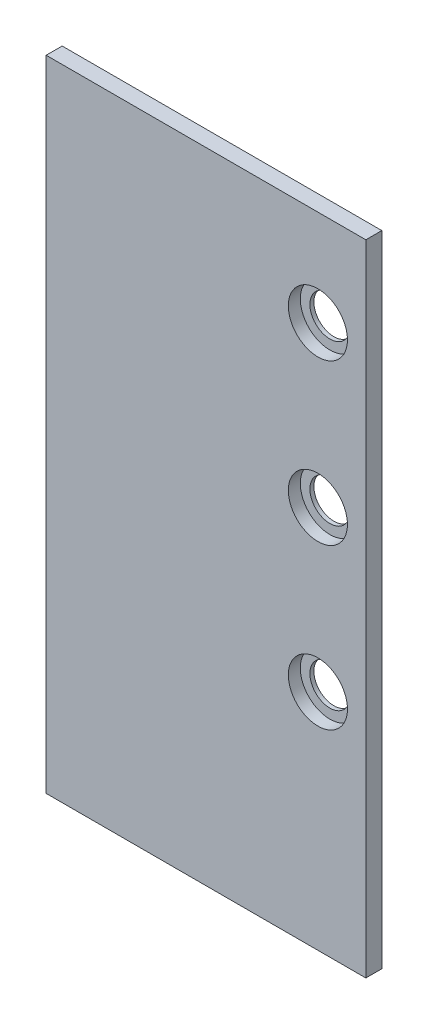
ISO-10303-21;
HEADER;
FILE_DESCRIPTION(('STEP AP214'),'2;1');
FILE_NAME('part.step','',(''),(''),'','','');
FILE_SCHEMA(('AUTOMOTIVE_DESIGN { 1 0 10303 214 1 1 1 1 }'));
ENDSEC;
DATA;
#1=APPLICATION_CONTEXT('core data for automotive mechanical design processes');
#2=APPLICATION_PROTOCOL_DEFINITION('international standard','automotive_design',2000,#1);
#3=PRODUCT_CONTEXT('',#1,'mechanical');
#4=PRODUCT('Part','Part','',(#3));
#5=PRODUCT_RELATED_PRODUCT_CATEGORY('part','',(#4));
#6=PRODUCT_DEFINITION_FORMATION('','',#4);
#7=PRODUCT_DEFINITION_CONTEXT('part definition',#1,'design');
#8=PRODUCT_DEFINITION('design','',#6,#7);
#9=PRODUCT_DEFINITION_SHAPE('','',#8);
#10=(LENGTH_UNIT() NAMED_UNIT(*) SI_UNIT(.MILLI.,.METRE.));
#11=(NAMED_UNIT(*) PLANE_ANGLE_UNIT() SI_UNIT($,.RADIAN.));
#12=(NAMED_UNIT(*) SI_UNIT($,.STERADIAN.) SOLID_ANGLE_UNIT());
#13=UNCERTAINTY_MEASURE_WITH_UNIT(LENGTH_MEASURE(1.E-05),#10,'distance_accuracy_value','');
#14=(GEOMETRIC_REPRESENTATION_CONTEXT(3) GLOBAL_UNCERTAINTY_ASSIGNED_CONTEXT((#13)) GLOBAL_UNIT_ASSIGNED_CONTEXT((#10,
#11,#12)) REPRESENTATION_CONTEXT('',''));
#15=CARTESIAN_POINT('',(0.,0.,0.));
#16=DIRECTION('',(0.,0.,1.));
#17=DIRECTION('',(1.,0.,0.));
#18=AXIS2_PLACEMENT_3D('',#15,#16,#17);
#19=CARTESIAN_POINT('',(65.5497332654698,303.566449619798,-3.175));
#20=DIRECTION('',(0.,0.,1.));
#21=DIRECTION('',(1.,0.,0.));
#22=AXIS2_PLACEMENT_3D('',#19,#20,#21);
#23=CYLINDRICAL_SURFACE('',#22,7.93749999999998);
#24=CARTESIAN_POINT('',(65.5497332654698,303.566449619798,-3.175));
#25=DIRECTION('',(0.,0.,1.));
#26=DIRECTION('',(1.,0.,0.));
#27=AXIS2_PLACEMENT_3D('',#24,#25,#26);
#28=CIRCLE('',#27,7.93749999999998);
#29=CARTESIAN_POINT('',(73.4872332654698,303.566449619798,-3.175));
#30=VERTEX_POINT('',#29);
#31=EDGE_CURVE('E113',#30,#30,#28,.T.);
#32=ORIENTED_EDGE('',*,*,#31,.F.);
#33=EDGE_LOOP('',(#32));
#34=FACE_BOUND('',#33,.T.);
#35=CARTESIAN_POINT('',(65.5497332654698,303.566449619798,-1.5875));
#36=DIRECTION('',(0.,0.,1.));
#37=DIRECTION('',(1.,0.,0.));
#38=AXIS2_PLACEMENT_3D('',#35,#36,#37);
#39=CIRCLE('',#38,7.93749999999998);
#40=CARTESIAN_POINT('',(73.4872332654698,303.566449619798,-1.5875));
#41=VERTEX_POINT('',#40);
#42=EDGE_CURVE('E11',#41,#41,#39,.T.);
#43=ORIENTED_EDGE('',*,*,#42,.T.);
#44=EDGE_LOOP('',(#43));
#45=FACE_BOUND('',#44,.T.);
#46=ADVANCED_FACE('F33',(#34,#45),#23,.F.);
#47=CARTESIAN_POINT('',(65.5497332654698,303.566449619798,-1.5875));
#48=DIRECTION('',(0.,0.,1.));
#49=DIRECTION('',(1.,0.,0.));
#50=AXIS2_PLACEMENT_3D('',#47,#48,#49);
#51=PLANE('',#50);
#52=ORIENTED_EDGE('',*,*,#42,.F.);
#53=EDGE_LOOP('',(#52));
#54=FACE_BOUND('',#53,.T.);
#55=CARTESIAN_POINT('',(65.5497332654698,303.566449619798,-1.5875));
#56=DIRECTION('',(0.,0.,1.));
#57=DIRECTION('',(1.,0.,0.));
#58=AXIS2_PLACEMENT_3D('',#55,#56,#57);
#59=CIRCLE('',#58,11.7475);
#60=CARTESIAN_POINT('',(77.2972332654698,303.566449619798,-1.5875));
#61=VERTEX_POINT('',#60);
#62=EDGE_CURVE('E41',#61,#61,#59,.T.);
#63=ORIENTED_EDGE('',*,*,#62,.T.);
#64=EDGE_LOOP('',(#63));
#65=FACE_BOUND('',#64,.T.);
#66=ADVANCED_FACE('F121',(#54,#65),#51,.T.);
#67=CARTESIAN_POINT('',(65.5497332654698,303.566449619798,-1.5875));
#68=DIRECTION('',(0.,0.,1.));
#69=DIRECTION('',(1.,0.,0.));
#70=AXIS2_PLACEMENT_3D('',#67,#68,#69);
#71=CYLINDRICAL_SURFACE('',#70,11.7475);
#72=ORIENTED_EDGE('',*,*,#62,.F.);
#73=EDGE_LOOP('',(#72));
#74=FACE_BOUND('',#73,.T.);
#75=CARTESIAN_POINT('',(65.5497332654698,303.566449619798,3.175));
#76=DIRECTION('',(0.,0.,1.));
#77=DIRECTION('',(1.,0.,0.));
#78=AXIS2_PLACEMENT_3D('',#75,#76,#77);
#79=CIRCLE('',#78,11.7475);
#80=CARTESIAN_POINT('',(77.2972332654698,303.566449619798,3.175));
#81=VERTEX_POINT('',#80);
#82=EDGE_CURVE('E116',#81,#81,#79,.T.);
#83=ORIENTED_EDGE('',*,*,#82,.T.);
#84=EDGE_LOOP('',(#83));
#85=FACE_BOUND('',#84,.T.);
#86=ADVANCED_FACE('F123',(#74,#85),#71,.F.);
#87=CARTESIAN_POINT('',(84.5997332654698,341.666449619798,3.175));
#88=DIRECTION('',(-1.,0.,0.));
#89=DIRECTION('',(0.,-1.,0.));
#90=AXIS2_PLACEMENT_3D('',#87,#88,#89);
#91=PLANE('',#90);
#92=DIRECTION('',(0.,1.,0.));
#93=VECTOR('',#92,1.);
#94=CARTESIAN_POINT('',(84.5997332654698,341.666449619798,-3.175));
#95=LINE('',#94,#93);
#96=CARTESIAN_POINT('',(84.5997332654698,87.6664496197977,-3.175));
#97=VERTEX_POINT('',#96);
#98=CARTESIAN_POINT('',(84.5997332654698,341.666449619798,-3.175));
#99=VERTEX_POINT('',#98);
#100=EDGE_CURVE('E102',#97,#99,#95,.T.);
#101=ORIENTED_EDGE('',*,*,#100,.T.);
#102=DIRECTION('',(0.,0.,-1.));
#103=VECTOR('',#102,1.);
#104=CARTESIAN_POINT('',(84.5997332654698,341.666449619798,3.175));
#105=LINE('',#104,#103);
#106=CARTESIAN_POINT('',(84.5997332654698,341.666449619798,3.175));
#107=VERTEX_POINT('',#106);
#108=EDGE_CURVE('E93',#107,#99,#105,.T.);
#109=ORIENTED_EDGE('',*,*,#108,.F.);
#110=DIRECTION('',(0.,1.,0.));
#111=VECTOR('',#110,1.);
#112=CARTESIAN_POINT('',(84.5997332654698,341.666449619798,3.175));
#113=LINE('',#112,#111);
#114=CARTESIAN_POINT('',(84.5997332654698,87.6664496197977,3.175));
#115=VERTEX_POINT('',#114);
#116=EDGE_CURVE('E85',#115,#107,#113,.T.);
#117=ORIENTED_EDGE('',*,*,#116,.F.);
#118=DIRECTION('',(0.,0.,-1.));
#119=VECTOR('',#118,1.);
#120=CARTESIAN_POINT('',(84.5997332654698,87.6664496197977,3.175));
#121=LINE('',#120,#119);
#122=EDGE_CURVE('E98',#115,#97,#121,.T.);
#123=ORIENTED_EDGE('',*,*,#122,.T.);
#124=EDGE_LOOP('',(#101,#109,#117,#123));
#125=FACE_BOUND('',#124,.T.);
#126=ADVANCED_FACE('F126',(#125),#91,.F.);
#127=CARTESIAN_POINT('',(84.5997332654698,341.666449619798,3.175));
#128=DIRECTION('',(0.,-1.,0.));
#129=DIRECTION('',(0.,0.,-1.));
#130=AXIS2_PLACEMENT_3D('',#127,#128,#129);
#131=PLANE('',#130);
#132=DIRECTION('',(-1.,0.,0.));
#133=VECTOR('',#132,1.);
#134=CARTESIAN_POINT('',(84.5997332654698,341.666449619798,-3.175));
#135=LINE('',#134,#133);
#136=CARTESIAN_POINT('',(-42.4002667345302,341.666449619798,-3.175));
#137=VERTEX_POINT('',#136);
#138=EDGE_CURVE('E91',#99,#137,#135,.T.);
#139=ORIENTED_EDGE('',*,*,#138,.T.);
#140=DIRECTION('',(0.,0.,-1.));
#141=VECTOR('',#140,1.);
#142=CARTESIAN_POINT('',(-42.4002667345302,341.666449619798,3.175));
#143=LINE('',#142,#141);
#144=CARTESIAN_POINT('',(-42.4002667345302,341.666449619798,3.175));
#145=VERTEX_POINT('',#144);
#146=EDGE_CURVE('E89',#145,#137,#143,.T.);
#147=ORIENTED_EDGE('',*,*,#146,.F.);
#148=DIRECTION('',(-1.,0.,0.));
#149=VECTOR('',#148,1.);
#150=CARTESIAN_POINT('',(84.5997332654698,341.666449619798,3.175));
#151=LINE('',#150,#149);
#152=EDGE_CURVE('E78',#107,#145,#151,.T.);
#153=ORIENTED_EDGE('',*,*,#152,.F.);
#154=ORIENTED_EDGE('',*,*,#108,.T.);
#155=EDGE_LOOP('',(#139,#147,#153,#154));
#156=FACE_BOUND('',#155,.T.);
#157=ADVANCED_FACE('F90',(#156),#131,.F.);
#158=CARTESIAN_POINT('',(-42.4002667345302,341.666449619798,3.175));
#159=DIRECTION('',(1.,0.,0.));
#160=DIRECTION('',(0.,1.,0.));
#161=AXIS2_PLACEMENT_3D('',#158,#159,#160);
#162=PLANE('',#161);
#163=DIRECTION('',(0.,-1.,0.));
#164=VECTOR('',#163,1.);
#165=CARTESIAN_POINT('',(-42.4002667345302,341.666449619798,-3.175));
#166=LINE('',#165,#164);
#167=CARTESIAN_POINT('',(-42.4002667345302,87.6664496197977,-3.175));
#168=VERTEX_POINT('',#167);
#169=EDGE_CURVE('E107',#137,#168,#166,.T.);
#170=ORIENTED_EDGE('',*,*,#169,.T.);
#171=DIRECTION('',(0.,0.,-1.));
#172=VECTOR('',#171,1.);
#173=CARTESIAN_POINT('',(-42.4002667345302,87.6664496197977,3.175));
#174=LINE('',#173,#172);
#175=CARTESIAN_POINT('',(-42.4002667345302,87.6664496197977,3.175));
#176=VERTEX_POINT('',#175);
#177=EDGE_CURVE('E94',#176,#168,#174,.T.);
#178=ORIENTED_EDGE('',*,*,#177,.F.);
#179=DIRECTION('',(0.,-1.,0.));
#180=VECTOR('',#179,1.);
#181=CARTESIAN_POINT('',(-42.4002667345302,341.666449619798,3.175));
#182=LINE('',#181,#180);
#183=EDGE_CURVE('E82',#145,#176,#182,.T.);
#184=ORIENTED_EDGE('',*,*,#183,.F.);
#185=ORIENTED_EDGE('',*,*,#146,.T.);
#186=EDGE_LOOP('',(#170,#178,#184,#185));
#187=FACE_BOUND('',#186,.T.);
#188=ADVANCED_FACE('F96',(#187),#162,.F.);
#189=CARTESIAN_POINT('',(84.5997332654698,87.6664496197977,3.175));
#190=DIRECTION('',(0.,1.,0.));
#191=DIRECTION('',(0.,0.,1.));
#192=AXIS2_PLACEMENT_3D('',#189,#190,#191);
#193=PLANE('',#192);
#194=DIRECTION('',(1.,0.,0.));
#195=VECTOR('',#194,1.);
#196=CARTESIAN_POINT('',(84.5997332654698,87.6664496197977,-3.175));
#197=LINE('',#196,#195);
#198=EDGE_CURVE('E66',#168,#97,#197,.T.);
#199=ORIENTED_EDGE('',*,*,#198,.T.);
#200=ORIENTED_EDGE('',*,*,#122,.F.);
#201=DIRECTION('',(1.,0.,0.));
#202=VECTOR('',#201,1.);
#203=CARTESIAN_POINT('',(-42.4002667345302,87.6664496197977,3.175));
#204=LINE('',#203,#202);
#205=EDGE_CURVE('E49',#176,#115,#204,.T.);
#206=ORIENTED_EDGE('',*,*,#205,.F.);
#207=ORIENTED_EDGE('',*,*,#177,.T.);
#208=EDGE_LOOP('',(#199,#200,#206,#207));
#209=FACE_BOUND('',#208,.T.);
#210=ADVANCED_FACE('F131',(#209),#193,.F.);
#211=CARTESIAN_POINT('',(0.,0.,3.175));
#212=DIRECTION('',(0.,0.,-1.));
#213=DIRECTION('',(-1.,0.,0.));
#214=AXIS2_PLACEMENT_3D('',#211,#212,#213);
#215=PLANE('',#214);
#216=CARTESIAN_POINT('',(65.5497332654698,240.066449619798,3.175));
#217=DIRECTION('',(0.,0.,1.));
#218=DIRECTION('',(1.,0.,0.));
#219=AXIS2_PLACEMENT_3D('',#216,#217,#218);
#220=CIRCLE('',#219,11.7475);
#221=CARTESIAN_POINT('',(77.2972332654698,240.066449619798,3.175));
#222=VERTEX_POINT('',#221);
#223=EDGE_CURVE('E267',#222,#222,#220,.T.);
#224=ORIENTED_EDGE('',*,*,#223,.F.);
#225=EDGE_LOOP('',(#224));
#226=FACE_BOUND('',#225,.T.);
#227=CARTESIAN_POINT('',(65.5497332654698,176.566449619798,3.175));
#228=DIRECTION('',(0.,0.,1.));
#229=DIRECTION('',(1.,0.,0.));
#230=AXIS2_PLACEMENT_3D('',#227,#228,#229);
#231=CIRCLE('',#230,11.7475);
#232=CARTESIAN_POINT('',(77.2972332654698,176.566449619798,3.175));
#233=VERTEX_POINT('',#232);
#234=EDGE_CURVE('E279',#233,#233,#231,.T.);
#235=ORIENTED_EDGE('',*,*,#234,.F.);
#236=EDGE_LOOP('',(#235));
#237=FACE_BOUND('',#236,.T.);
#238=ORIENTED_EDGE('',*,*,#116,.T.);
#239=ORIENTED_EDGE('',*,*,#152,.T.);
#240=ORIENTED_EDGE('',*,*,#183,.T.);
#241=ORIENTED_EDGE('',*,*,#205,.T.);
#242=EDGE_LOOP('',(#238,#239,#240,#241));
#243=FACE_BOUND('',#242,.T.);
#244=ORIENTED_EDGE('',*,*,#82,.F.);
#245=EDGE_LOOP('',(#244));
#246=FACE_BOUND('',#245,.T.);
#247=ADVANCED_FACE('F79',(#226,#237,#243,#246),#215,.F.);
#248=CARTESIAN_POINT('',(0.,0.,-3.175));
#249=DIRECTION('',(0.,0.,-1.));
#250=DIRECTION('',(-1.,0.,0.));
#251=AXIS2_PLACEMENT_3D('',#248,#249,#250);
#252=PLANE('',#251);
#253=CARTESIAN_POINT('',(65.5497332654698,240.066449619798,-3.175));
#254=DIRECTION('',(0.,0.,1.));
#255=DIRECTION('',(1.,0.,0.));
#256=AXIS2_PLACEMENT_3D('',#253,#254,#255);
#257=CIRCLE('',#256,7.93749999999998);
#258=CARTESIAN_POINT('',(73.4872332654698,240.066449619798,-3.175));
#259=VERTEX_POINT('',#258);
#260=EDGE_CURVE('E262',#259,#259,#257,.T.);
#261=ORIENTED_EDGE('',*,*,#260,.T.);
#262=EDGE_LOOP('',(#261));
#263=FACE_BOUND('',#262,.T.);
#264=CARTESIAN_POINT('',(65.5497332654698,176.566449619798,-3.175));
#265=DIRECTION('',(0.,0.,1.));
#266=DIRECTION('',(1.,0.,0.));
#267=AXIS2_PLACEMENT_3D('',#264,#265,#266);
#268=CIRCLE('',#267,7.93749999999998);
#269=CARTESIAN_POINT('',(73.4872332654698,176.566449619798,-3.175));
#270=VERTEX_POINT('',#269);
#271=EDGE_CURVE('E276',#270,#270,#268,.T.);
#272=ORIENTED_EDGE('',*,*,#271,.T.);
#273=EDGE_LOOP('',(#272));
#274=FACE_BOUND('',#273,.T.);
#275=ORIENTED_EDGE('',*,*,#100,.F.);
#276=ORIENTED_EDGE('',*,*,#198,.F.);
#277=ORIENTED_EDGE('',*,*,#169,.F.);
#278=ORIENTED_EDGE('',*,*,#138,.F.);
#279=EDGE_LOOP('',(#275,#276,#277,#278));
#280=FACE_BOUND('',#279,.T.);
#281=ORIENTED_EDGE('',*,*,#31,.T.);
#282=EDGE_LOOP('',(#281));
#283=FACE_BOUND('',#282,.T.);
#284=ADVANCED_FACE('F130',(#263,#274,#280,#283),#252,.T.);
#285=CARTESIAN_POINT('',(65.5497332654698,176.566449619798,-1.5875));
#286=DIRECTION('',(0.,0.,1.));
#287=DIRECTION('',(1.,0.,0.));
#288=AXIS2_PLACEMENT_3D('',#285,#286,#287);
#289=CYLINDRICAL_SURFACE('',#288,11.7475);
#290=CARTESIAN_POINT('',(65.5497332654698,176.566449619798,-1.5875));
#291=DIRECTION('',(0.,0.,1.));
#292=DIRECTION('',(1.,0.,0.));
#293=AXIS2_PLACEMENT_3D('',#290,#291,#292);
#294=CIRCLE('',#293,11.7475);
#295=CARTESIAN_POINT('',(77.2972332654698,176.566449619798,-1.5875));
#296=VERTEX_POINT('',#295);
#297=EDGE_CURVE('E105',#296,#296,#294,.T.);
#298=ORIENTED_EDGE('',*,*,#297,.F.);
#299=EDGE_LOOP('',(#298));
#300=FACE_BOUND('',#299,.T.);
#301=ORIENTED_EDGE('',*,*,#234,.T.);
#302=EDGE_LOOP('',(#301));
#303=FACE_BOUND('',#302,.T.);
#304=ADVANCED_FACE('F138',(#300,#303),#289,.F.);
#305=CARTESIAN_POINT('',(65.5497332654698,176.566449619798,-1.5875));
#306=DIRECTION('',(0.,0.,1.));
#307=DIRECTION('',(1.,0.,0.));
#308=AXIS2_PLACEMENT_3D('',#305,#306,#307);
#309=PLANE('',#308);
#310=CARTESIAN_POINT('',(65.5497332654698,176.566449619798,-1.5875));
#311=DIRECTION('',(0.,0.,1.));
#312=DIRECTION('',(1.,0.,0.));
#313=AXIS2_PLACEMENT_3D('',#310,#311,#312);
#314=CIRCLE('',#313,7.93749999999998);
#315=CARTESIAN_POINT('',(73.4872332654698,176.566449619798,-1.5875));
#316=VERTEX_POINT('',#315);
#317=EDGE_CURVE('E270',#316,#316,#314,.T.);
#318=ORIENTED_EDGE('',*,*,#317,.F.);
#319=EDGE_LOOP('',(#318));
#320=FACE_BOUND('',#319,.T.);
#321=ORIENTED_EDGE('',*,*,#297,.T.);
#322=EDGE_LOOP('',(#321));
#323=FACE_BOUND('',#322,.T.);
#324=ADVANCED_FACE('F183',(#320,#323),#309,.T.);
#325=CARTESIAN_POINT('',(65.5497332654698,176.566449619798,-3.175));
#326=DIRECTION('',(0.,0.,1.));
#327=DIRECTION('',(1.,0.,0.));
#328=AXIS2_PLACEMENT_3D('',#325,#326,#327);
#329=CYLINDRICAL_SURFACE('',#328,7.93749999999998);
#330=ORIENTED_EDGE('',*,*,#271,.F.);
#331=EDGE_LOOP('',(#330));
#332=FACE_BOUND('',#331,.T.);
#333=ORIENTED_EDGE('',*,*,#317,.T.);
#334=EDGE_LOOP('',(#333));
#335=FACE_BOUND('',#334,.T.);
#336=ADVANCED_FACE('F193',(#332,#335),#329,.F.);
#337=CARTESIAN_POINT('',(65.5497332654698,240.066449619798,-1.5875));
#338=DIRECTION('',(0.,0.,1.));
#339=DIRECTION('',(1.,0.,0.));
#340=AXIS2_PLACEMENT_3D('',#337,#338,#339);
#341=CYLINDRICAL_SURFACE('',#340,11.7475);
#342=CARTESIAN_POINT('',(65.5497332654698,240.066449619798,-1.5875));
#343=DIRECTION('',(0.,0.,1.));
#344=DIRECTION('',(1.,0.,0.));
#345=AXIS2_PLACEMENT_3D('',#342,#343,#344);
#346=CIRCLE('',#345,11.7475);
#347=CARTESIAN_POINT('',(77.2972332654698,240.066449619798,-1.5875));
#348=VERTEX_POINT('',#347);
#349=EDGE_CURVE('E266',#348,#348,#346,.T.);
#350=ORIENTED_EDGE('',*,*,#349,.F.);
#351=EDGE_LOOP('',(#350));
#352=FACE_BOUND('',#351,.T.);
#353=ORIENTED_EDGE('',*,*,#223,.T.);
#354=EDGE_LOOP('',(#353));
#355=FACE_BOUND('',#354,.T.);
#356=ADVANCED_FACE('F202',(#352,#355),#341,.F.);
#357=CARTESIAN_POINT('',(65.5497332654698,240.066449619798,-1.5875));
#358=DIRECTION('',(0.,0.,1.));
#359=DIRECTION('',(1.,0.,0.));
#360=AXIS2_PLACEMENT_3D('',#357,#358,#359);
#361=PLANE('',#360);
#362=CARTESIAN_POINT('',(65.5497332654698,240.066449619798,-1.5875));
#363=DIRECTION('',(0.,0.,1.));
#364=DIRECTION('',(1.,0.,0.));
#365=AXIS2_PLACEMENT_3D('',#362,#363,#364);
#366=CIRCLE('',#365,7.93749999999998);
#367=CARTESIAN_POINT('',(73.4872332654698,240.066449619798,-1.5875));
#368=VERTEX_POINT('',#367);
#369=EDGE_CURVE('E265',#368,#368,#366,.T.);
#370=ORIENTED_EDGE('',*,*,#369,.F.);
#371=EDGE_LOOP('',(#370));
#372=FACE_BOUND('',#371,.T.);
#373=ORIENTED_EDGE('',*,*,#349,.T.);
#374=EDGE_LOOP('',(#373));
#375=FACE_BOUND('',#374,.T.);
#376=ADVANCED_FACE('F235',(#372,#375),#361,.T.);
#377=CARTESIAN_POINT('',(65.5497332654698,240.066449619798,-3.175));
#378=DIRECTION('',(0.,0.,1.));
#379=DIRECTION('',(1.,0.,0.));
#380=AXIS2_PLACEMENT_3D('',#377,#378,#379);
#381=CYLINDRICAL_SURFACE('',#380,7.93749999999998);
#382=ORIENTED_EDGE('',*,*,#260,.F.);
#383=EDGE_LOOP('',(#382));
#384=FACE_BOUND('',#383,.T.);
#385=ORIENTED_EDGE('',*,*,#369,.T.);
#386=EDGE_LOOP('',(#385));
#387=FACE_BOUND('',#386,.T.);
#388=ADVANCED_FACE('F245',(#384,#387),#381,.F.);
#389=CLOSED_SHELL('',(#46,#66,#86,#126,#157,#188,#210,#247,#284,#304,#324,#336,#356,#376,#388));
#390=MANIFOLD_SOLID_BREP('B2',#389);
#391=ADVANCED_BREP_SHAPE_REPRESENTATION('',(#18,#390),#14);
#392=SHAPE_DEFINITION_REPRESENTATION(#9,#391);
ENDSEC;
END-ISO-10303-21;
